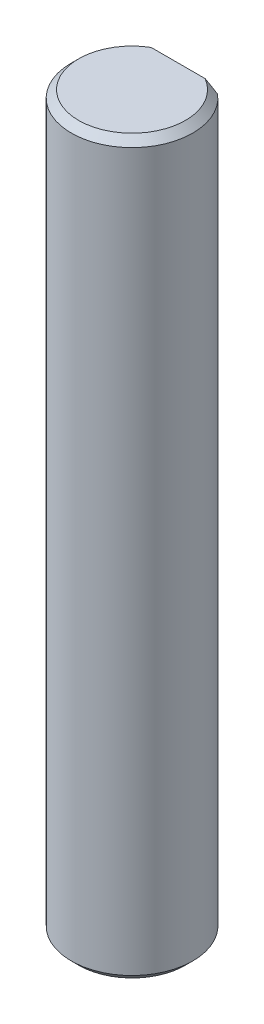
ISO-10303-21;
HEADER;
FILE_DESCRIPTION(('STEP AP214'),'2;1');
FILE_NAME('part.step','',(''),(''),'','','');
FILE_SCHEMA(('AUTOMOTIVE_DESIGN { 1 0 10303 214 1 1 1 1 }'));
ENDSEC;
DATA;
#1=APPLICATION_CONTEXT('core data for automotive mechanical design processes');
#2=APPLICATION_PROTOCOL_DEFINITION('international standard','automotive_design',2000,#1);
#3=PRODUCT_CONTEXT('',#1,'mechanical');
#4=PRODUCT('Part','Part','',(#3));
#5=PRODUCT_RELATED_PRODUCT_CATEGORY('part','',(#4));
#6=PRODUCT_DEFINITION_FORMATION('','',#4);
#7=PRODUCT_DEFINITION_CONTEXT('part definition',#1,'design');
#8=PRODUCT_DEFINITION('design','',#6,#7);
#9=PRODUCT_DEFINITION_SHAPE('','',#8);
#10=(LENGTH_UNIT() NAMED_UNIT(*) SI_UNIT(.MILLI.,.METRE.));
#11=(NAMED_UNIT(*) PLANE_ANGLE_UNIT() SI_UNIT($,.RADIAN.));
#12=(NAMED_UNIT(*) SI_UNIT($,.STERADIAN.) SOLID_ANGLE_UNIT());
#13=UNCERTAINTY_MEASURE_WITH_UNIT(LENGTH_MEASURE(1.E-05),#10,'distance_accuracy_value','');
#14=(GEOMETRIC_REPRESENTATION_CONTEXT(3) GLOBAL_UNCERTAINTY_ASSIGNED_CONTEXT((#13)) GLOBAL_UNIT_ASSIGNED_CONTEXT((#10,
#11,#12)) REPRESENTATION_CONTEXT('',''));
#15=CARTESIAN_POINT('',(0.,0.,0.));
#16=DIRECTION('',(0.,0.,1.));
#17=DIRECTION('',(1.,0.,0.));
#18=AXIS2_PLACEMENT_3D('',#15,#16,#17);
#19=CARTESIAN_POINT('',(0.,50.,0.));
#20=DIRECTION('',(0.,-1.,0.));
#21=DIRECTION('',(0.,0.,-1.));
#22=AXIS2_PLACEMENT_3D('',#19,#20,#21);
#23=CYLINDRICAL_SURFACE('',#22,4.15);
#24=DIRECTION('',(0.,1.,0.));
#25=VECTOR('',#24,1.);
#26=CARTESIAN_POINT('',(2.70185121722126,34.,-3.15));
#27=LINE('',#26,#25);
#28=CARTESIAN_POINT('',(2.70185121722126,34.,-3.15));
#29=VERTEX_POINT('',#28);
#30=CARTESIAN_POINT('',(2.70185121722126,49.5,-3.15));
#31=VERTEX_POINT('',#30);
#32=EDGE_CURVE('E125',#29,#31,#27,.T.);
#33=ORIENTED_EDGE('',*,*,#32,.T.);
#34=CARTESIAN_POINT('',(0.,49.5,0.));
#35=DIRECTION('',(0.,1.,0.));
#36=DIRECTION('',(0.,0.,1.));
#37=AXIS2_PLACEMENT_3D('',#34,#35,#36);
#38=CIRCLE('',#37,4.15);
#39=CARTESIAN_POINT('',(-2.70185121722126,49.5,-3.15));
#40=VERTEX_POINT('',#39);
#41=EDGE_CURVE('E128',#31,#40,#38,.F.);
#42=ORIENTED_EDGE('',*,*,#41,.T.);
#43=DIRECTION('',(0.,1.,0.));
#44=VECTOR('',#43,1.);
#45=CARTESIAN_POINT('',(-2.70185121722126,34.,-3.15));
#46=LINE('',#45,#44);
#47=CARTESIAN_POINT('',(-2.70185121722126,34.,-3.15));
#48=VERTEX_POINT('',#47);
#49=EDGE_CURVE('E123',#48,#40,#46,.T.);
#50=ORIENTED_EDGE('',*,*,#49,.F.);
#51=CARTESIAN_POINT('',(0.,34.,0.));
#52=DIRECTION('',(0.,1.,0.));
#53=DIRECTION('',(0.,0.,1.));
#54=AXIS2_PLACEMENT_3D('',#51,#52,#53);
#55=CIRCLE('',#54,4.15);
#56=EDGE_CURVE('E118',#29,#48,#55,.T.);
#57=ORIENTED_EDGE('',*,*,#56,.F.);
#58=EDGE_LOOP('',(#33,#42,#50,#57));
#59=FACE_BOUND('',#58,.T.);
#60=DIRECTION('',(0.,-1.,0.));
#61=VECTOR('',#60,1.);
#62=CARTESIAN_POINT('',(-2.70185121722126,16.,-3.15));
#63=LINE('',#62,#61);
#64=CARTESIAN_POINT('',(-2.70185121722126,16.,-3.15));
#65=VERTEX_POINT('',#64);
#66=CARTESIAN_POINT('',(-2.70185121722126,0.5,-3.15));
#67=VERTEX_POINT('',#66);
#68=EDGE_CURVE('E101',#65,#67,#63,.T.);
#69=ORIENTED_EDGE('',*,*,#68,.T.);
#70=CARTESIAN_POINT('',(0.,0.5,0.));
#71=DIRECTION('',(0.,1.,0.));
#72=DIRECTION('',(0.,0.,1.));
#73=AXIS2_PLACEMENT_3D('',#70,#71,#72);
#74=CIRCLE('',#73,4.15);
#75=CARTESIAN_POINT('',(2.70185121722126,0.5,-3.15));
#76=VERTEX_POINT('',#75);
#77=EDGE_CURVE('E112',#67,#76,#74,.T.);
#78=ORIENTED_EDGE('',*,*,#77,.T.);
#79=DIRECTION('',(0.,-1.,0.));
#80=VECTOR('',#79,1.);
#81=CARTESIAN_POINT('',(2.70185121722126,16.,-3.15));
#82=LINE('',#81,#80);
#83=CARTESIAN_POINT('',(2.70185121722126,16.,-3.15));
#84=VERTEX_POINT('',#83);
#85=EDGE_CURVE('E99',#84,#76,#82,.T.);
#86=ORIENTED_EDGE('',*,*,#85,.F.);
#87=CARTESIAN_POINT('',(0.,16.,0.));
#88=DIRECTION('',(0.,1.,0.));
#89=DIRECTION('',(0.,0.,1.));
#90=AXIS2_PLACEMENT_3D('',#87,#88,#89);
#91=CIRCLE('',#90,4.15);
#92=EDGE_CURVE('E104',#84,#65,#91,.T.);
#93=ORIENTED_EDGE('',*,*,#92,.T.);
#94=EDGE_LOOP('',(#69,#78,#86,#93));
#95=FACE_BOUND('',#94,.T.);
#96=ADVANCED_FACE('F35',(#59,#95),#23,.T.);
#97=CARTESIAN_POINT('',(0.,0.,0.));
#98=DIRECTION('',(0.,1.,0.));
#99=DIRECTION('',(0.,0.,1.));
#100=AXIS2_PLACEMENT_3D('',#97,#98,#99);
#101=PLANE('',#100);
#102=DIRECTION('',(1.,0.,0.));
#103=VECTOR('',#102,1.);
#104=CARTESIAN_POINT('',(-2.70185121722126,0.,-3.15));
#105=LINE('',#104,#103);
#106=CARTESIAN_POINT('',(-1.84390889145858,0.,-3.15));
#107=VERTEX_POINT('',#106);
#108=CARTESIAN_POINT('',(1.84390889145858,0.,-3.15));
#109=VERTEX_POINT('',#108);
#110=EDGE_CURVE('E108',#107,#109,#105,.T.);
#111=ORIENTED_EDGE('',*,*,#110,.T.);
#112=CARTESIAN_POINT('',(0.,0.,0.));
#113=DIRECTION('',(0.,1.,0.));
#114=DIRECTION('',(0.,0.,1.));
#115=AXIS2_PLACEMENT_3D('',#112,#113,#114);
#116=CIRCLE('',#115,3.65);
#117=EDGE_CURVE('E178',#109,#107,#116,.F.);
#118=ORIENTED_EDGE('',*,*,#117,.T.);
#119=EDGE_LOOP('',(#111,#118));
#120=FACE_BOUND('',#119,.T.);
#121=ADVANCED_FACE('F159',(#120),#101,.F.);
#122=CARTESIAN_POINT('',(0.,50.,0.));
#123=DIRECTION('',(0.,1.,0.));
#124=DIRECTION('',(0.,0.,1.));
#125=AXIS2_PLACEMENT_3D('',#122,#123,#124);
#126=PLANE('',#125);
#127=DIRECTION('',(1.,0.,0.));
#128=VECTOR('',#127,1.);
#129=CARTESIAN_POINT('',(-2.70185121722126,50.,-3.15));
#130=LINE('',#129,#128);
#131=CARTESIAN_POINT('',(-1.84390889145856,50.,-3.15));
#132=VERTEX_POINT('',#131);
#133=CARTESIAN_POINT('',(1.84390889145856,50.,-3.15));
#134=VERTEX_POINT('',#133);
#135=EDGE_CURVE('E114',#132,#134,#130,.T.);
#136=ORIENTED_EDGE('',*,*,#135,.F.);
#137=CARTESIAN_POINT('',(0.,50.,0.));
#138=DIRECTION('',(0.,1.,0.));
#139=DIRECTION('',(0.,0.,1.));
#140=AXIS2_PLACEMENT_3D('',#137,#138,#139);
#141=CIRCLE('',#140,3.64999999999999);
#142=EDGE_CURVE('E177',#132,#134,#141,.T.);
#143=ORIENTED_EDGE('',*,*,#142,.T.);
#144=EDGE_LOOP('',(#136,#143));
#145=FACE_BOUND('',#144,.T.);
#146=ADVANCED_FACE('F163',(#145),#126,.T.);
#147=CARTESIAN_POINT('',(-2.70185121722126,34.,-3.15));
#148=DIRECTION('',(0.,0.,1.));
#149=DIRECTION('',(1.,0.,0.));
#150=AXIS2_PLACEMENT_3D('',#147,#148,#149);
#151=PLANE('',#150);
#152=ORIENTED_EDGE('',*,*,#135,.T.);
#153=CARTESIAN_POINT('',(1.84390889145856,50.,-3.15));
#154=CARTESIAN_POINT('',(1.91784146654186,49.9626398299899,-3.15));
#155=CARTESIAN_POINT('',(1.9910981268822,49.9239698702899,-3.15));
#156=CARTESIAN_POINT('',(2.13631789989146,49.8443926526132,-3.15));
#157=CARTESIAN_POINT('',(2.20828192735406,49.803487066929,-3.15));
#158=CARTESIAN_POINT('',(2.35107298536371,49.7197708633114,-3.15));
#159=CARTESIAN_POINT('',(2.42190018205027,49.6769605272571,-3.15));
#160=CARTESIAN_POINT('',(2.56258787360102,49.589664017783,-3.15));
#161=CARTESIAN_POINT('',(2.63244761676461,49.5451766313647,-3.15));
#162=CARTESIAN_POINT('',(2.70185121722126,49.5,-3.15));
#163=B_SPLINE_CURVE_WITH_KNOTS('',3,(#153,#154,#155,#156,#157,#158,#159,#160,#161,#162),
.UNSPECIFIED.,.F.,.F.,(4,2,2,2,4),(0.,0.248477002471357,0.496770617533311,0.74502760970497,
0.993467745791525),.UNSPECIFIED.);
#164=EDGE_CURVE('E11',#134,#31,#163,.T.);
#165=ORIENTED_EDGE('',*,*,#164,.T.);
#166=ORIENTED_EDGE('',*,*,#32,.F.);
#167=DIRECTION('',(1.,0.,0.));
#168=VECTOR('',#167,1.);
#169=CARTESIAN_POINT('',(-2.70185121722126,34.,-3.15));
#170=LINE('',#169,#168);
#171=EDGE_CURVE('E120',#48,#29,#170,.T.);
#172=ORIENTED_EDGE('',*,*,#171,.F.);
#173=ORIENTED_EDGE('',*,*,#49,.T.);
#174=CARTESIAN_POINT('',(-2.70185121722126,49.5,-3.15));
#175=CARTESIAN_POINT('',(-2.63244761676461,49.5451766313647,-3.15));
#176=CARTESIAN_POINT('',(-2.56258787360102,49.589664017783,-3.15));
#177=CARTESIAN_POINT('',(-2.42190018205027,49.6769605272571,-3.15));
#178=CARTESIAN_POINT('',(-2.35107298536371,49.7197708633114,-3.15));
#179=CARTESIAN_POINT('',(-2.20828192735406,49.803487066929,-3.15));
#180=CARTESIAN_POINT('',(-2.13631789989146,49.8443926526132,-3.15));
#181=CARTESIAN_POINT('',(-1.9910981268822,49.9239698702899,-3.15));
#182=CARTESIAN_POINT('',(-1.91784146654186,49.9626398299899,-3.15));
#183=CARTESIAN_POINT('',(-1.84390889145856,50.,-3.15));
#184=B_SPLINE_CURVE_WITH_KNOTS('',3,(#174,#175,#176,#177,#178,#179,#180,#181,#182,#183),
.UNSPECIFIED.,.F.,.F.,(4,2,2,2,4),(0.,0.248440136086556,0.496697128258214,0.744990743320168,
0.993467745791526),.UNSPECIFIED.);
#185=EDGE_CURVE('E50',#40,#132,#184,.T.);
#186=ORIENTED_EDGE('',*,*,#185,.T.);
#187=EDGE_LOOP('',(#152,#165,#166,#172,#173,#186));
#188=FACE_BOUND('',#187,.T.);
#189=ADVANCED_FACE('F166',(#188),#151,.F.);
#190=CARTESIAN_POINT('',(0.,34.,0.));
#191=DIRECTION('',(0.,1.,0.));
#192=DIRECTION('',(0.,0.,1.));
#193=AXIS2_PLACEMENT_3D('',#190,#191,#192);
#194=PLANE('',#193);
#195=ORIENTED_EDGE('',*,*,#56,.T.);
#196=ORIENTED_EDGE('',*,*,#171,.T.);
#197=EDGE_LOOP('',(#195,#196));
#198=FACE_BOUND('',#197,.T.);
#199=ADVANCED_FACE('F170',(#198),#194,.T.);
#200=CARTESIAN_POINT('',(-2.70185121722126,16.,-3.15));
#201=DIRECTION('',(0.,0.,-1.));
#202=DIRECTION('',(-1.,0.,0.));
#203=AXIS2_PLACEMENT_3D('',#200,#201,#202);
#204=PLANE('',#203);
#205=ORIENTED_EDGE('',*,*,#85,.T.);
#206=CARTESIAN_POINT('',(2.70185121722126,0.5,-3.15));
#207=CARTESIAN_POINT('',(2.63244761676461,0.45482336863525,-3.15));
#208=CARTESIAN_POINT('',(2.56258787360102,0.410335982217037,-3.15));
#209=CARTESIAN_POINT('',(2.42190018205027,0.323039472742948,-3.15));
#210=CARTESIAN_POINT('',(2.35107298536372,0.28022913668855,-3.15));
#211=CARTESIAN_POINT('',(2.20828192735407,0.196512933070989,-3.15));
#212=CARTESIAN_POINT('',(2.13631789989147,0.155607347386807,-3.15));
#213=CARTESIAN_POINT('',(1.99109812688221,0.076030129710074,-3.15));
#214=CARTESIAN_POINT('',(1.91784146654187,0.0373601700101066,-3.15));
#215=CARTESIAN_POINT('',(1.84390889145858,0.,-3.15));
#216=B_SPLINE_CURVE_WITH_KNOTS('',3,(#206,#207,#208,#209,#210,#211,#212,#213,#214,#215),
.UNSPECIFIED.,.F.,.F.,(4,2,2,2,4),(0.,0.248440136086552,0.496697128258205,0.744990743320156,
0.99346774579151),.UNSPECIFIED.);
#217=EDGE_CURVE('E139',#76,#109,#216,.T.);
#218=ORIENTED_EDGE('',*,*,#217,.T.);
#219=ORIENTED_EDGE('',*,*,#110,.F.);
#220=CARTESIAN_POINT('',(-1.84390889145858,0.,-3.15));
#221=CARTESIAN_POINT('',(-1.91784146654187,0.0373601700101066,-3.15));
#222=CARTESIAN_POINT('',(-1.99109812688221,0.0760301297100741,-3.15));
#223=CARTESIAN_POINT('',(-2.13631789989147,0.155607347386807,-3.15));
#224=CARTESIAN_POINT('',(-2.20828192735407,0.196512933070989,-3.15));
#225=CARTESIAN_POINT('',(-2.35107298536372,0.28022913668855,-3.15));
#226=CARTESIAN_POINT('',(-2.42190018205027,0.323039472742948,-3.15));
#227=CARTESIAN_POINT('',(-2.56258787360102,0.410335982217037,-3.15));
#228=CARTESIAN_POINT('',(-2.63244761676461,0.45482336863525,-3.15));
#229=CARTESIAN_POINT('',(-2.70185121722126,0.5,-3.15));
#230=B_SPLINE_CURVE_WITH_KNOTS('',3,(#220,#221,#222,#223,#224,#225,#226,#227,#228,#229),
.UNSPECIFIED.,.F.,.F.,(4,2,2,2,4),(0.,0.248477002471354,0.496770617533305,0.745027609704958,
0.993467745791509),.UNSPECIFIED.);
#231=EDGE_CURVE('E132',#107,#67,#230,.T.);
#232=ORIENTED_EDGE('',*,*,#231,.T.);
#233=ORIENTED_EDGE('',*,*,#68,.F.);
#234=DIRECTION('',(1.,0.,0.));
#235=VECTOR('',#234,1.);
#236=CARTESIAN_POINT('',(-2.70185121722126,16.,-3.15));
#237=LINE('',#236,#235);
#238=EDGE_CURVE('E95',#65,#84,#237,.T.);
#239=ORIENTED_EDGE('',*,*,#238,.T.);
#240=EDGE_LOOP('',(#205,#218,#219,#232,#233,#239));
#241=FACE_BOUND('',#240,.T.);
#242=ADVANCED_FACE('F97',(#241),#204,.T.);
#243=CARTESIAN_POINT('',(0.,16.,0.));
#244=DIRECTION('',(0.,-1.,0.));
#245=DIRECTION('',(0.,0.,1.));
#246=AXIS2_PLACEMENT_3D('',#243,#244,#245);
#247=PLANE('',#246);
#248=ORIENTED_EDGE('',*,*,#92,.F.);
#249=ORIENTED_EDGE('',*,*,#238,.F.);
#250=EDGE_LOOP('',(#248,#249));
#251=FACE_BOUND('',#250,.T.);
#252=ADVANCED_FACE('F106',(#251),#247,.T.);
#253=CARTESIAN_POINT('',(0.,0.5,0.));
#254=DIRECTION('',(0.,1.,0.));
#255=DIRECTION('',(0.,0.,1.));
#256=AXIS2_PLACEMENT_3D('',#253,#254,#255);
#257=CONICAL_SURFACE('',#256,4.15,0.785398163397447);
#258=ORIENTED_EDGE('',*,*,#231,.F.);
#259=ORIENTED_EDGE('',*,*,#117,.F.);
#260=ORIENTED_EDGE('',*,*,#217,.F.);
#261=ORIENTED_EDGE('',*,*,#77,.F.);
#262=EDGE_LOOP('',(#258,#259,#260,#261));
#263=FACE_BOUND('',#262,.T.);
#264=ADVANCED_FACE('F149',(#263),#257,.T.);
#265=CARTESIAN_POINT('',(0.,50.,0.));
#266=DIRECTION('',(0.,-1.,0.));
#267=DIRECTION('',(0.,0.,-1.));
#268=AXIS2_PLACEMENT_3D('',#265,#266,#267);
#269=CONICAL_SURFACE('',#268,3.64999999999999,0.785398163397447);
#270=ORIENTED_EDGE('',*,*,#185,.F.);
#271=ORIENTED_EDGE('',*,*,#41,.F.);
#272=ORIENTED_EDGE('',*,*,#164,.F.);
#273=ORIENTED_EDGE('',*,*,#142,.F.);
#274=EDGE_LOOP('',(#270,#271,#272,#273));
#275=FACE_BOUND('',#274,.T.);
#276=ADVANCED_FACE('F38',(#275),#269,.T.);
#277=CLOSED_SHELL('',(#96,#121,#146,#189,#199,#242,#252,#264,#276));
#278=MANIFOLD_SOLID_BREP('B2',#277);
#279=ADVANCED_BREP_SHAPE_REPRESENTATION('',(#18,#278),#14);
#280=SHAPE_DEFINITION_REPRESENTATION(#9,#279);
ENDSEC;
END-ISO-10303-21;
